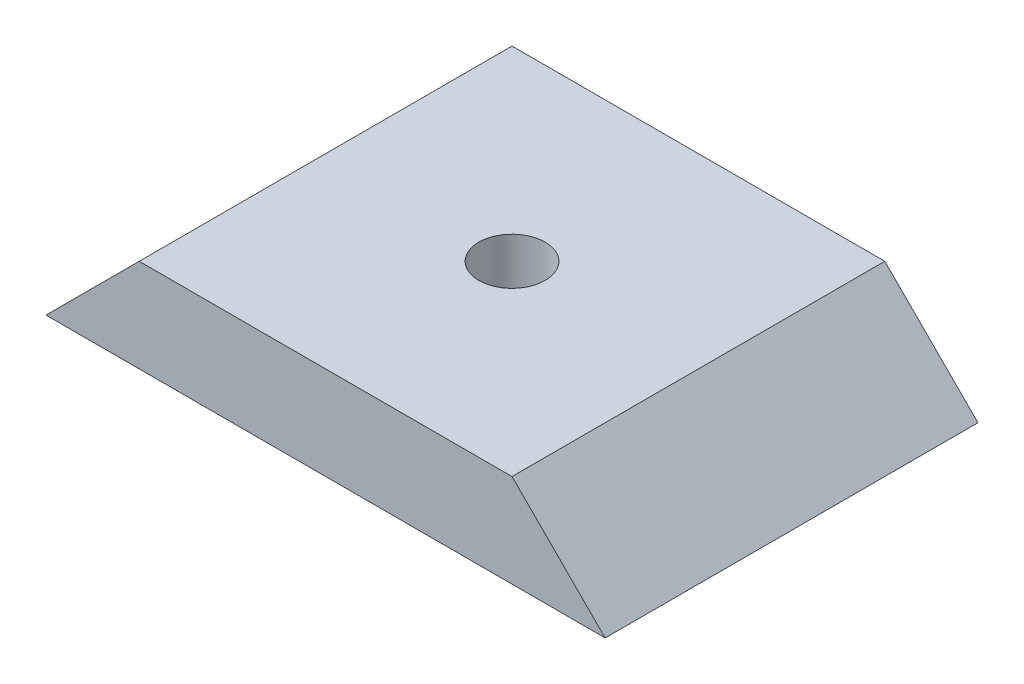
ISO-10303-21;
HEADER;
FILE_DESCRIPTION(('STEP AP214'),'2;1');
FILE_NAME('part.step','',(''),(''),'','','');
FILE_SCHEMA(('AUTOMOTIVE_DESIGN { 1 0 10303 214 1 1 1 1 }'));
ENDSEC;
DATA;
#1=APPLICATION_CONTEXT('core data for automotive mechanical design processes');
#2=APPLICATION_PROTOCOL_DEFINITION('international standard','automotive_design',2000,#1);
#3=PRODUCT_CONTEXT('',#1,'mechanical');
#4=PRODUCT('Part','Part','',(#3));
#5=PRODUCT_RELATED_PRODUCT_CATEGORY('part','',(#4));
#6=PRODUCT_DEFINITION_FORMATION('','',#4);
#7=PRODUCT_DEFINITION_CONTEXT('part definition',#1,'design');
#8=PRODUCT_DEFINITION('design','',#6,#7);
#9=PRODUCT_DEFINITION_SHAPE('','',#8);
#10=(LENGTH_UNIT() NAMED_UNIT(*) SI_UNIT(.MILLI.,.METRE.));
#11=(NAMED_UNIT(*) PLANE_ANGLE_UNIT() SI_UNIT($,.RADIAN.));
#12=(NAMED_UNIT(*) SI_UNIT($,.STERADIAN.) SOLID_ANGLE_UNIT());
#13=UNCERTAINTY_MEASURE_WITH_UNIT(LENGTH_MEASURE(1.E-05),#10,'distance_accuracy_value','');
#14=(GEOMETRIC_REPRESENTATION_CONTEXT(3) GLOBAL_UNCERTAINTY_ASSIGNED_CONTEXT((#13)) GLOBAL_UNIT_ASSIGNED_CONTEXT((#10,
#11,#12)) REPRESENTATION_CONTEXT('',''));
#15=CARTESIAN_POINT('',(0.,0.,0.));
#16=DIRECTION('',(0.,0.,1.));
#17=DIRECTION('',(1.,0.,0.));
#18=AXIS2_PLACEMENT_3D('',#15,#16,#17);
#19=CARTESIAN_POINT('',(0.,3.175,0.));
#20=DIRECTION('',(0.,0.,-1.));
#21=DIRECTION('',(-1.,0.,0.));
#22=AXIS2_PLACEMENT_3D('',#19,#20,#21);
#23=PLANE('',#22);
#24=DIRECTION('',(1.,0.,0.));
#25=VECTOR('',#24,1.);
#26=CARTESIAN_POINT('',(0.,0.,0.));
#27=LINE('',#26,#25);
#28=CARTESIAN_POINT('',(0.,0.,0.));
#29=VERTEX_POINT('',#28);
#30=CARTESIAN_POINT('',(19.05,0.,0.));
#31=VERTEX_POINT('',#30);
#32=EDGE_CURVE('E93',#29,#31,#27,.T.);
#33=ORIENTED_EDGE('',*,*,#32,.T.);
#34=DIRECTION('',(0.707106781186546,-0.707106781186549,0.));
#35=VECTOR('',#34,1.);
#36=CARTESIAN_POINT('',(15.875,3.175,0.));
#37=LINE('',#36,#35);
#38=CARTESIAN_POINT('',(15.875,3.175,0.));
#39=VERTEX_POINT('',#38);
#40=EDGE_CURVE('E11',#31,#39,#37,.F.);
#41=ORIENTED_EDGE('',*,*,#40,.T.);
#42=DIRECTION('',(1.,0.,0.));
#43=VECTOR('',#42,1.);
#44=CARTESIAN_POINT('',(0.,3.175,0.));
#45=LINE('',#44,#43);
#46=CARTESIAN_POINT('',(3.17500000000001,3.175,0.));
#47=VERTEX_POINT('',#46);
#48=EDGE_CURVE('E100',#47,#39,#45,.T.);
#49=ORIENTED_EDGE('',*,*,#48,.F.);
#50=DIRECTION('',(-0.707106781186549,-0.707106781186546,0.));
#51=VECTOR('',#50,1.);
#52=CARTESIAN_POINT('',(0.,0.,0.));
#53=LINE('',#52,#51);
#54=EDGE_CURVE('E44',#47,#29,#53,.T.);
#55=ORIENTED_EDGE('',*,*,#54,.T.);
#56=EDGE_LOOP('',(#33,#41,#49,#55));
#57=FACE_BOUND('',#56,.T.);
#58=ADVANCED_FACE('F35',(#57),#23,.F.);
#59=CARTESIAN_POINT('',(0.,3.175,-12.7));
#60=DIRECTION('',(0.,0.,-1.));
#61=DIRECTION('',(-1.,0.,0.));
#62=AXIS2_PLACEMENT_3D('',#59,#60,#61);
#63=PLANE('',#62);
#64=DIRECTION('',(1.,0.,0.));
#65=VECTOR('',#64,1.);
#66=CARTESIAN_POINT('',(0.,3.175,-12.7));
#67=LINE('',#66,#65);
#68=CARTESIAN_POINT('',(3.17500000000001,3.175,-12.7));
#69=VERTEX_POINT('',#68);
#70=CARTESIAN_POINT('',(15.875,3.175,-12.7));
#71=VERTEX_POINT('',#70);
#72=EDGE_CURVE('E105',#69,#71,#67,.T.);
#73=ORIENTED_EDGE('',*,*,#72,.T.);
#74=DIRECTION('',(-0.707106781186546,0.707106781186549,0.));
#75=VECTOR('',#74,1.);
#76=CARTESIAN_POINT('',(7.93750000000003,11.1125,-12.7));
#77=LINE('',#76,#75);
#78=CARTESIAN_POINT('',(19.05,0.,-12.7));
#79=VERTEX_POINT('',#78);
#80=EDGE_CURVE('E51',#71,#79,#77,.F.);
#81=ORIENTED_EDGE('',*,*,#80,.T.);
#82=DIRECTION('',(1.,0.,0.));
#83=VECTOR('',#82,1.);
#84=CARTESIAN_POINT('',(0.,0.,-12.7));
#85=LINE('',#84,#83);
#86=CARTESIAN_POINT('',(0.,0.,-12.7));
#87=VERTEX_POINT('',#86);
#88=EDGE_CURVE('E85',#87,#79,#85,.T.);
#89=ORIENTED_EDGE('',*,*,#88,.F.);
#90=DIRECTION('',(0.707106781186549,0.707106781186546,0.));
#91=VECTOR('',#90,1.);
#92=CARTESIAN_POINT('',(1.5875,1.58749999999999,-12.7));
#93=LINE('',#92,#91);
#94=EDGE_CURVE('E59',#87,#69,#93,.T.);
#95=ORIENTED_EDGE('',*,*,#94,.T.);
#96=EDGE_LOOP('',(#73,#81,#89,#95));
#97=FACE_BOUND('',#96,.T.);
#98=ADVANCED_FACE('F86',(#97),#63,.T.);
#99=CARTESIAN_POINT('',(0.,3.175,0.));
#100=DIRECTION('',(0.,-1.,0.));
#101=DIRECTION('',(0.,0.,-1.));
#102=AXIS2_PLACEMENT_3D('',#99,#100,#101);
#103=PLANE('',#102);
#104=CARTESIAN_POINT('',(9.525,3.175,-6.35));
#105=DIRECTION('',(0.,-1.,0.));
#106=DIRECTION('',(0.,0.,-1.));
#107=AXIS2_PLACEMENT_3D('',#104,#105,#106);
#108=CIRCLE('',#107,1.1303);
#109=CARTESIAN_POINT('',(9.525,3.175,-7.4803));
#110=VERTEX_POINT('',#109);
#111=EDGE_CURVE('E94',#110,#110,#108,.T.);
#112=ORIENTED_EDGE('',*,*,#111,.T.);
#113=EDGE_LOOP('',(#112));
#114=FACE_BOUND('',#113,.T.);
#115=ORIENTED_EDGE('',*,*,#48,.T.);
#116=DIRECTION('',(0.,0.,-1.));
#117=VECTOR('',#116,1.);
#118=CARTESIAN_POINT('',(15.875,3.175,0.));
#119=LINE('',#118,#117);
#120=EDGE_CURVE('E82',#39,#71,#119,.T.);
#121=ORIENTED_EDGE('',*,*,#120,.T.);
#122=ORIENTED_EDGE('',*,*,#72,.F.);
#123=DIRECTION('',(0.,0.,1.));
#124=VECTOR('',#123,1.);
#125=CARTESIAN_POINT('',(3.17500000000001,3.175,0.));
#126=LINE('',#125,#124);
#127=EDGE_CURVE('E81',#69,#47,#126,.T.);
#128=ORIENTED_EDGE('',*,*,#127,.T.);
#129=EDGE_LOOP('',(#115,#121,#122,#128));
#130=FACE_BOUND('',#129,.T.);
#131=ADVANCED_FACE('F121',(#114,#130),#103,.F.);
#132=CARTESIAN_POINT('',(0.,0.,0.));
#133=DIRECTION('',(0.,-1.,0.));
#134=DIRECTION('',(0.,0.,-1.));
#135=AXIS2_PLACEMENT_3D('',#132,#133,#134);
#136=PLANE('',#135);
#137=CARTESIAN_POINT('',(9.525,0.,-6.35));
#138=DIRECTION('',(0.,-1.,0.));
#139=DIRECTION('',(0.,0.,-1.));
#140=AXIS2_PLACEMENT_3D('',#137,#138,#139);
#141=CIRCLE('',#140,1.1303);
#142=CARTESIAN_POINT('',(9.525,0.,-7.4803));
#143=VERTEX_POINT('',#142);
#144=EDGE_CURVE('E97',#143,#143,#141,.T.);
#145=ORIENTED_EDGE('',*,*,#144,.F.);
#146=EDGE_LOOP('',(#145));
#147=FACE_BOUND('',#146,.T.);
#148=DIRECTION('',(0.,0.,-1.));
#149=VECTOR('',#148,1.);
#150=CARTESIAN_POINT('',(0.,0.,0.));
#151=LINE('',#150,#149);
#152=EDGE_CURVE('E80',#29,#87,#151,.T.);
#153=ORIENTED_EDGE('',*,*,#152,.T.);
#154=ORIENTED_EDGE('',*,*,#88,.T.);
#155=DIRECTION('',(0.,0.,-1.));
#156=VECTOR('',#155,1.);
#157=CARTESIAN_POINT('',(19.05,0.,0.));
#158=LINE('',#157,#156);
#159=EDGE_CURVE('E89',#31,#79,#158,.T.);
#160=ORIENTED_EDGE('',*,*,#159,.F.);
#161=ORIENTED_EDGE('',*,*,#32,.F.);
#162=EDGE_LOOP('',(#153,#154,#160,#161));
#163=FACE_BOUND('',#162,.T.);
#164=ADVANCED_FACE('F92',(#147,#163),#136,.T.);
#165=CARTESIAN_POINT('',(15.875,3.175,0.));
#166=DIRECTION('',(-0.707106781186549,-0.707106781186546,0.));
#167=DIRECTION('',(0.,0.,-1.));
#168=AXIS2_PLACEMENT_3D('',#165,#166,#167);
#169=PLANE('',#168);
#170=ORIENTED_EDGE('',*,*,#40,.F.);
#171=ORIENTED_EDGE('',*,*,#159,.T.);
#172=ORIENTED_EDGE('',*,*,#80,.F.);
#173=ORIENTED_EDGE('',*,*,#120,.F.);
#174=EDGE_LOOP('',(#170,#171,#172,#173));
#175=FACE_BOUND('',#174,.T.);
#176=ADVANCED_FACE('F120',(#175),#169,.F.);
#177=CARTESIAN_POINT('',(0.,0.,0.));
#178=DIRECTION('',(-0.707106781186546,0.707106781186549,0.));
#179=DIRECTION('',(0.,0.,1.));
#180=AXIS2_PLACEMENT_3D('',#177,#178,#179);
#181=PLANE('',#180);
#182=ORIENTED_EDGE('',*,*,#54,.F.);
#183=ORIENTED_EDGE('',*,*,#127,.F.);
#184=ORIENTED_EDGE('',*,*,#94,.F.);
#185=ORIENTED_EDGE('',*,*,#152,.F.);
#186=EDGE_LOOP('',(#182,#183,#184,#185));
#187=FACE_BOUND('',#186,.T.);
#188=ADVANCED_FACE('F38',(#187),#181,.T.);
#189=CARTESIAN_POINT('',(9.525,0.,-6.35));
#190=DIRECTION('',(0.,-1.,0.));
#191=DIRECTION('',(0.,0.,-1.));
#192=AXIS2_PLACEMENT_3D('',#189,#190,#191);
#193=CYLINDRICAL_SURFACE('',#192,1.1303);
#194=ORIENTED_EDGE('',*,*,#111,.F.);
#195=EDGE_LOOP('',(#194));
#196=FACE_BOUND('',#195,.T.);
#197=ORIENTED_EDGE('',*,*,#144,.T.);
#198=EDGE_LOOP('',(#197));
#199=FACE_BOUND('',#198,.T.);
#200=ADVANCED_FACE('F117',(#196,#199),#193,.F.);
#201=CLOSED_SHELL('',(#58,#98,#131,#164,#176,#188,#200));
#202=MANIFOLD_SOLID_BREP('B2',#201);
#203=ADVANCED_BREP_SHAPE_REPRESENTATION('',(#18,#202),#14);
#204=SHAPE_DEFINITION_REPRESENTATION(#9,#203);
ENDSEC;
END-ISO-10303-21;
